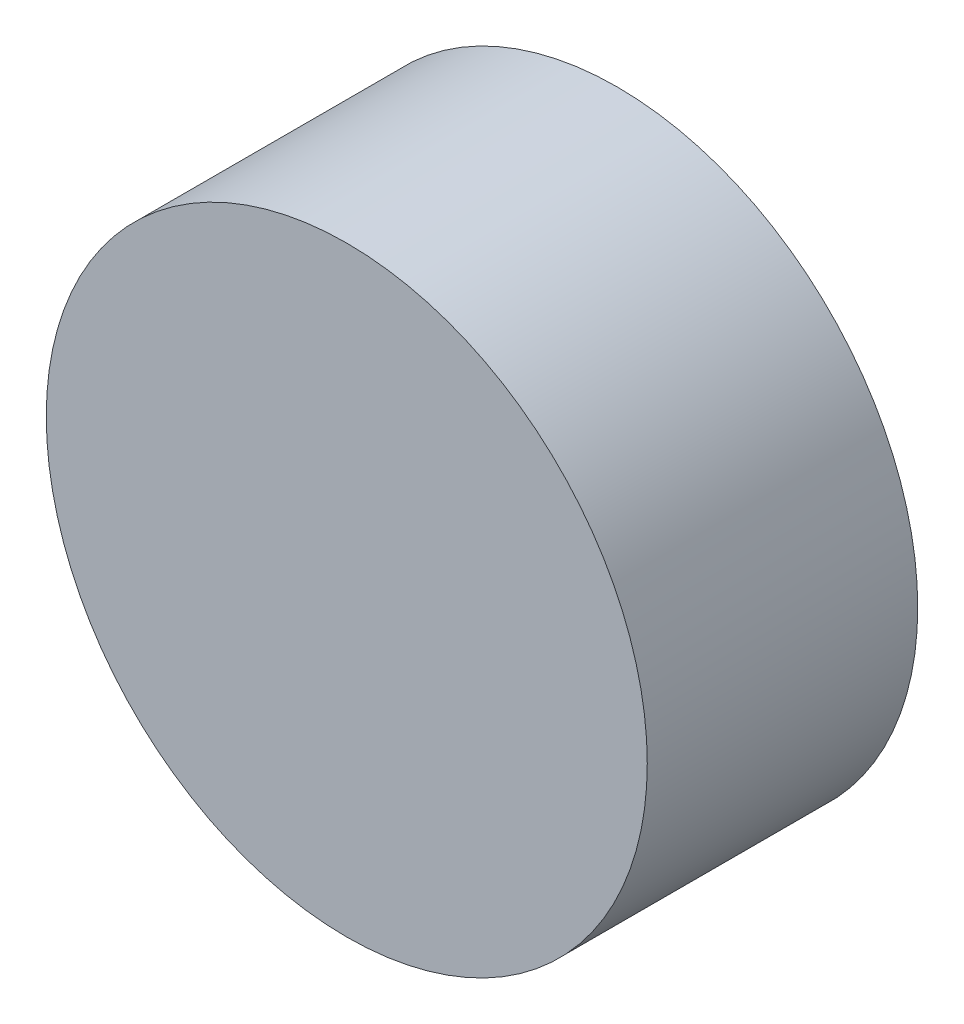
ISO-10303-21;
HEADER;
FILE_DESCRIPTION(('STEP AP214'),'2;1');
FILE_NAME('part.step','',(''),(''),'','','');
FILE_SCHEMA(('AUTOMOTIVE_DESIGN { 1 0 10303 214 1 1 1 1 }'));
ENDSEC;
DATA;
#1=APPLICATION_CONTEXT('core data for automotive mechanical design processes');
#2=APPLICATION_PROTOCOL_DEFINITION('international standard','automotive_design',2000,#1);
#3=PRODUCT_CONTEXT('',#1,'mechanical');
#4=PRODUCT('Part','Part','',(#3));
#5=PRODUCT_RELATED_PRODUCT_CATEGORY('part','',(#4));
#6=PRODUCT_DEFINITION_FORMATION('','',#4);
#7=PRODUCT_DEFINITION_CONTEXT('part definition',#1,'design');
#8=PRODUCT_DEFINITION('design','',#6,#7);
#9=PRODUCT_DEFINITION_SHAPE('','',#8);
#10=(LENGTH_UNIT() NAMED_UNIT(*) SI_UNIT(.MILLI.,.METRE.));
#11=(NAMED_UNIT(*) PLANE_ANGLE_UNIT() SI_UNIT($,.RADIAN.));
#12=(NAMED_UNIT(*) SI_UNIT($,.STERADIAN.) SOLID_ANGLE_UNIT());
#13=UNCERTAINTY_MEASURE_WITH_UNIT(LENGTH_MEASURE(1.E-05),#10,'distance_accuracy_value','');
#14=(GEOMETRIC_REPRESENTATION_CONTEXT(3) GLOBAL_UNCERTAINTY_ASSIGNED_CONTEXT((#13)) GLOBAL_UNIT_ASSIGNED_CONTEXT((#10,
#11,#12)) REPRESENTATION_CONTEXT('',''));
#15=CARTESIAN_POINT('',(0.,0.,0.));
#16=DIRECTION('',(0.,0.,1.));
#17=DIRECTION('',(1.,0.,0.));
#18=AXIS2_PLACEMENT_3D('',#15,#16,#17);
#19=CARTESIAN_POINT('',(0.,0.,18.));
#20=DIRECTION('',(0.,0.,-1.));
#21=DIRECTION('',(-1.,0.,0.));
#22=AXIS2_PLACEMENT_3D('',#19,#20,#21);
#23=CYLINDRICAL_SURFACE('',#22,20.);
#24=CARTESIAN_POINT('',(0.,0.,18.));
#25=DIRECTION('',(0.,0.,1.));
#26=DIRECTION('',(1.,0.,0.));
#27=AXIS2_PLACEMENT_3D('',#24,#25,#26);
#28=CIRCLE('',#27,20.);
#29=CARTESIAN_POINT('',(20.,0.,18.));
#30=VERTEX_POINT('',#29);
#31=EDGE_CURVE('E10',#30,#30,#28,.T.);
#32=ORIENTED_EDGE('',*,*,#31,.F.);
#33=EDGE_LOOP('',(#32));
#34=FACE_BOUND('',#33,.T.);
#35=CARTESIAN_POINT('',(0.,0.,0.));
#36=DIRECTION('',(0.,0.,1.));
#37=DIRECTION('',(1.,0.,0.));
#38=AXIS2_PLACEMENT_3D('',#35,#36,#37);
#39=CIRCLE('',#38,20.);
#40=CARTESIAN_POINT('',(20.,0.,0.));
#41=VERTEX_POINT('',#40);
#42=EDGE_CURVE('E40',#41,#41,#39,.T.);
#43=ORIENTED_EDGE('',*,*,#42,.T.);
#44=EDGE_LOOP('',(#43));
#45=FACE_BOUND('',#44,.T.);
#46=ADVANCED_FACE('F37',(#34,#45),#23,.T.);
#47=CARTESIAN_POINT('',(0.,0.,18.));
#48=DIRECTION('',(0.,0.,1.));
#49=DIRECTION('',(1.,0.,0.));
#50=AXIS2_PLACEMENT_3D('',#47,#48,#49);
#51=PLANE('',#50);
#52=ORIENTED_EDGE('',*,*,#31,.T.);
#53=EDGE_LOOP('',(#52));
#54=FACE_BOUND('',#53,.T.);
#55=ADVANCED_FACE('F52',(#54),#51,.T.);
#56=CARTESIAN_POINT('',(0.,0.,0.));
#57=DIRECTION('',(0.,0.,1.));
#58=DIRECTION('',(1.,0.,0.));
#59=AXIS2_PLACEMENT_3D('',#56,#57,#58);
#60=PLANE('',#59);
#61=ORIENTED_EDGE('',*,*,#42,.F.);
#62=EDGE_LOOP('',(#61));
#63=FACE_BOUND('',#62,.T.);
#64=ADVANCED_FACE('F50',(#63),#60,.F.);
#65=CLOSED_SHELL('',(#46,#55,#64));
#66=MANIFOLD_SOLID_BREP('B2',#65);
#67=ADVANCED_BREP_SHAPE_REPRESENTATION('',(#18,#66),#14);
#68=SHAPE_DEFINITION_REPRESENTATION(#9,#67);
ENDSEC;
END-ISO-10303-21;
